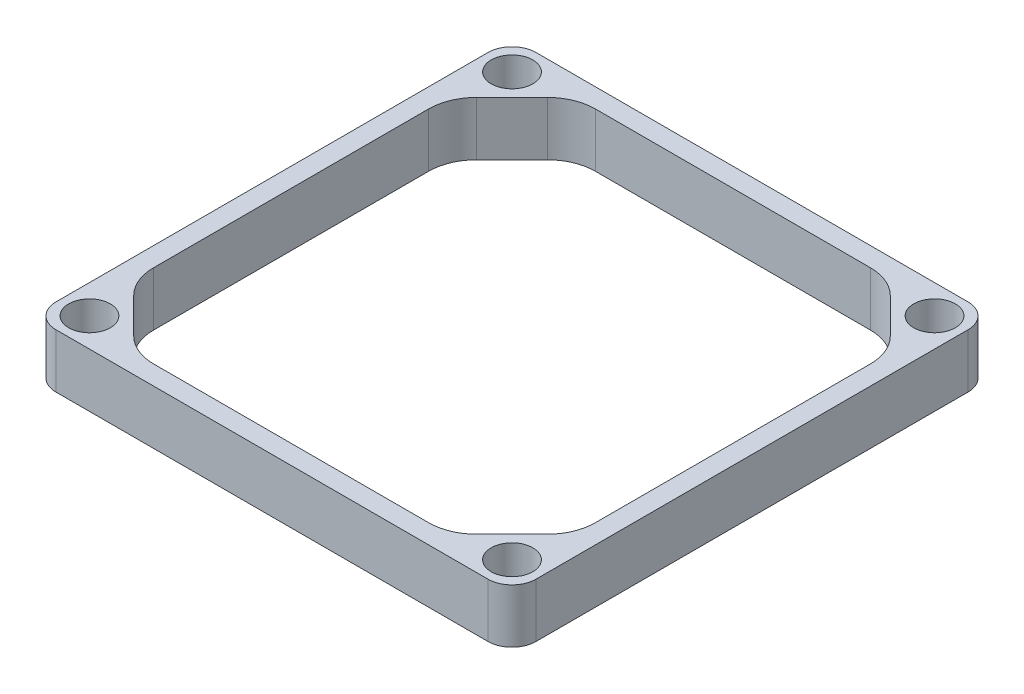
ISO-10303-21;
HEADER;
FILE_DESCRIPTION(('STEP AP214'),'2;1');
FILE_NAME('part.step','',(''),(''),'','','');
FILE_SCHEMA(('AUTOMOTIVE_DESIGN { 1 0 10303 214 1 1 1 1 }'));
ENDSEC;
DATA;
#1=APPLICATION_CONTEXT('core data for automotive mechanical design processes');
#2=APPLICATION_PROTOCOL_DEFINITION('international standard','automotive_design',2000,#1);
#3=PRODUCT_CONTEXT('',#1,'mechanical');
#4=PRODUCT('Part','Part','',(#3));
#5=PRODUCT_RELATED_PRODUCT_CATEGORY('part','',(#4));
#6=PRODUCT_DEFINITION_FORMATION('','',#4);
#7=PRODUCT_DEFINITION_CONTEXT('part definition',#1,'design');
#8=PRODUCT_DEFINITION('design','',#6,#7);
#9=PRODUCT_DEFINITION_SHAPE('','',#8);
#10=(LENGTH_UNIT() NAMED_UNIT(*) SI_UNIT(.MILLI.,.METRE.));
#11=(NAMED_UNIT(*) PLANE_ANGLE_UNIT() SI_UNIT($,.RADIAN.));
#12=(NAMED_UNIT(*) SI_UNIT($,.STERADIAN.) SOLID_ANGLE_UNIT());
#13=UNCERTAINTY_MEASURE_WITH_UNIT(LENGTH_MEASURE(1.E-05),#10,'distance_accuracy_value','');
#14=(GEOMETRIC_REPRESENTATION_CONTEXT(3) GLOBAL_UNCERTAINTY_ASSIGNED_CONTEXT((#13)) GLOBAL_UNIT_ASSIGNED_CONTEXT((#10,
#11,#12)) REPRESENTATION_CONTEXT('',''));
#15=CARTESIAN_POINT('',(0.,0.,0.));
#16=DIRECTION('',(0.,0.,1.));
#17=DIRECTION('',(1.,0.,0.));
#18=AXIS2_PLACEMENT_3D('',#15,#16,#17);
#19=CARTESIAN_POINT('',(-57.15,3.175,57.15));
#20=DIRECTION('',(0.,-1.,0.));
#21=DIRECTION('',(0.,0.,-1.));
#22=AXIS2_PLACEMENT_3D('',#19,#20,#21);
#23=CYLINDRICAL_SURFACE('',#22,6.35);
#24=CARTESIAN_POINT('',(-57.15,14.2875,57.15));
#25=DIRECTION('',(0.,-1.,0.));
#26=DIRECTION('',(0.,0.,-1.));
#27=AXIS2_PLACEMENT_3D('',#24,#25,#26);
#28=CIRCLE('',#27,6.35);
#29=CARTESIAN_POINT('',(-57.15,14.2875,63.5));
#30=VERTEX_POINT('',#29);
#31=CARTESIAN_POINT('',(-63.5,14.2875,57.15));
#32=VERTEX_POINT('',#31);
#33=EDGE_CURVE('E48',#30,#32,#28,.T.);
#34=ORIENTED_EDGE('',*,*,#33,.F.);
#35=DIRECTION('',(0.,-1.,0.));
#36=VECTOR('',#35,1.);
#37=CARTESIAN_POINT('',(-57.15,3.175,63.5));
#38=LINE('',#37,#36);
#39=CARTESIAN_POINT('',(-57.15,28.575,63.5));
#40=VERTEX_POINT('',#39);
#41=EDGE_CURVE('E11',#40,#30,#38,.T.);
#42=ORIENTED_EDGE('',*,*,#41,.F.);
#43=CARTESIAN_POINT('',(-57.15,28.575,57.15));
#44=DIRECTION('',(0.,1.,0.));
#45=DIRECTION('',(0.,0.,1.));
#46=AXIS2_PLACEMENT_3D('',#43,#44,#45);
#47=CIRCLE('',#46,6.35);
#48=CARTESIAN_POINT('',(-63.5,28.575,57.15));
#49=VERTEX_POINT('',#48);
#50=EDGE_CURVE('E262',#49,#40,#47,.T.);
#51=ORIENTED_EDGE('',*,*,#50,.F.);
#52=DIRECTION('',(0.,-1.,0.));
#53=VECTOR('',#52,1.);
#54=CARTESIAN_POINT('',(-63.5,3.175,57.15));
#55=LINE('',#54,#53);
#56=EDGE_CURVE('E286',#49,#32,#55,.T.);
#57=ORIENTED_EDGE('',*,*,#56,.T.);
#58=EDGE_LOOP('',(#34,#42,#51,#57));
#59=FACE_BOUND('',#58,.T.);
#60=ADVANCED_FACE('F33',(#59),#23,.T.);
#61=CARTESIAN_POINT('',(-57.15,3.175,63.5));
#62=DIRECTION('',(0.,0.,-1.));
#63=DIRECTION('',(-1.,0.,0.));
#64=AXIS2_PLACEMENT_3D('',#61,#62,#63);
#65=PLANE('',#64);
#66=DIRECTION('',(-1.,0.,0.));
#67=VECTOR('',#66,1.);
#68=CARTESIAN_POINT('',(-57.15,14.2875,63.5));
#69=LINE('',#68,#67);
#70=CARTESIAN_POINT('',(57.15,14.2875,63.5));
#71=VERTEX_POINT('',#70);
#72=EDGE_CURVE('E314',#71,#30,#69,.T.);
#73=ORIENTED_EDGE('',*,*,#72,.F.);
#74=DIRECTION('',(0.,-1.,0.));
#75=VECTOR('',#74,1.);
#76=CARTESIAN_POINT('',(57.15,3.175,63.5));
#77=LINE('',#76,#75);
#78=CARTESIAN_POINT('',(57.15,28.575,63.5));
#79=VERTEX_POINT('',#78);
#80=EDGE_CURVE('E41',#79,#71,#77,.T.);
#81=ORIENTED_EDGE('',*,*,#80,.F.);
#82=DIRECTION('',(1.,0.,0.));
#83=VECTOR('',#82,1.);
#84=CARTESIAN_POINT('',(-57.15,28.575,63.5));
#85=LINE('',#84,#83);
#86=EDGE_CURVE('E265',#40,#79,#85,.T.);
#87=ORIENTED_EDGE('',*,*,#86,.F.);
#88=ORIENTED_EDGE('',*,*,#41,.T.);
#89=EDGE_LOOP('',(#73,#81,#87,#88));
#90=FACE_BOUND('',#89,.T.);
#91=ADVANCED_FACE('F313',(#90),#65,.F.);
#92=CARTESIAN_POINT('',(57.15,3.175,57.15));
#93=DIRECTION('',(0.,-1.,0.));
#94=DIRECTION('',(0.,0.,-1.));
#95=AXIS2_PLACEMENT_3D('',#92,#93,#94);
#96=CYLINDRICAL_SURFACE('',#95,6.35);
#97=CARTESIAN_POINT('',(57.15,14.2875,57.15));
#98=DIRECTION('',(0.,-1.,0.));
#99=DIRECTION('',(0.,0.,-1.));
#100=AXIS2_PLACEMENT_3D('',#97,#98,#99);
#101=CIRCLE('',#100,6.35);
#102=CARTESIAN_POINT('',(63.5,14.2875,57.15));
#103=VERTEX_POINT('',#102);
#104=EDGE_CURVE('E309',#103,#71,#101,.T.);
#105=ORIENTED_EDGE('',*,*,#104,.F.);
#106=DIRECTION('',(0.,-1.,0.));
#107=VECTOR('',#106,1.);
#108=CARTESIAN_POINT('',(63.5,3.175,57.15));
#109=LINE('',#108,#107);
#110=CARTESIAN_POINT('',(63.5,28.575,57.15));
#111=VERTEX_POINT('',#110);
#112=EDGE_CURVE('E301',#111,#103,#109,.T.);
#113=ORIENTED_EDGE('',*,*,#112,.F.);
#114=CARTESIAN_POINT('',(57.15,28.575,57.15));
#115=DIRECTION('',(0.,1.,0.));
#116=DIRECTION('',(0.,0.,1.));
#117=AXIS2_PLACEMENT_3D('',#114,#115,#116);
#118=CIRCLE('',#117,6.35);
#119=EDGE_CURVE('E268',#79,#111,#118,.T.);
#120=ORIENTED_EDGE('',*,*,#119,.F.);
#121=ORIENTED_EDGE('',*,*,#80,.T.);
#122=EDGE_LOOP('',(#105,#113,#120,#121));
#123=FACE_BOUND('',#122,.T.);
#124=ADVANCED_FACE('F308',(#123),#96,.T.);
#125=CARTESIAN_POINT('',(63.5,3.175,-57.15));
#126=DIRECTION('',(-1.,0.,0.));
#127=DIRECTION('',(0.,0.,1.));
#128=AXIS2_PLACEMENT_3D('',#125,#126,#127);
#129=PLANE('',#128);
#130=DIRECTION('',(0.,0.,1.));
#131=VECTOR('',#130,1.);
#132=CARTESIAN_POINT('',(63.5,14.2875,-57.15));
#133=LINE('',#132,#131);
#134=CARTESIAN_POINT('',(63.5,14.2875,-57.15));
#135=VERTEX_POINT('',#134);
#136=EDGE_CURVE('E378',#135,#103,#133,.T.);
#137=ORIENTED_EDGE('',*,*,#136,.F.);
#138=DIRECTION('',(0.,-1.,0.));
#139=VECTOR('',#138,1.);
#140=CARTESIAN_POINT('',(63.5,3.175,-57.15));
#141=LINE('',#140,#139);
#142=CARTESIAN_POINT('',(63.5,28.575,-57.15));
#143=VERTEX_POINT('',#142);
#144=EDGE_CURVE('E298',#143,#135,#141,.T.);
#145=ORIENTED_EDGE('',*,*,#144,.F.);
#146=DIRECTION('',(0.,0.,-1.));
#147=VECTOR('',#146,1.);
#148=CARTESIAN_POINT('',(63.5,28.575,57.15));
#149=LINE('',#148,#147);
#150=EDGE_CURVE('E271',#111,#143,#149,.T.);
#151=ORIENTED_EDGE('',*,*,#150,.F.);
#152=ORIENTED_EDGE('',*,*,#112,.T.);
#153=EDGE_LOOP('',(#137,#145,#151,#152));
#154=FACE_BOUND('',#153,.T.);
#155=ADVANCED_FACE('F382',(#154),#129,.F.);
#156=CARTESIAN_POINT('',(57.15,3.175,-57.15));
#157=DIRECTION('',(0.,-1.,0.));
#158=DIRECTION('',(0.,0.,-1.));
#159=AXIS2_PLACEMENT_3D('',#156,#157,#158);
#160=CYLINDRICAL_SURFACE('',#159,6.35);
#161=CARTESIAN_POINT('',(57.15,14.2875,-57.15));
#162=DIRECTION('',(0.,-1.,0.));
#163=DIRECTION('',(0.,0.,-1.));
#164=AXIS2_PLACEMENT_3D('',#161,#162,#163);
#165=CIRCLE('',#164,6.35);
#166=CARTESIAN_POINT('',(57.15,14.2875,-63.5));
#167=VERTEX_POINT('',#166);
#168=EDGE_CURVE('E376',#167,#135,#165,.T.);
#169=ORIENTED_EDGE('',*,*,#168,.F.);
#170=DIRECTION('',(0.,-1.,0.));
#171=VECTOR('',#170,1.);
#172=CARTESIAN_POINT('',(57.15,3.175,-63.5));
#173=LINE('',#172,#171);
#174=CARTESIAN_POINT('',(57.15,28.575,-63.5));
#175=VERTEX_POINT('',#174);
#176=EDGE_CURVE('E295',#175,#167,#173,.T.);
#177=ORIENTED_EDGE('',*,*,#176,.F.);
#178=CARTESIAN_POINT('',(57.15,28.575,-57.15));
#179=DIRECTION('',(0.,1.,0.));
#180=DIRECTION('',(0.,0.,1.));
#181=AXIS2_PLACEMENT_3D('',#178,#179,#180);
#182=CIRCLE('',#181,6.35);
#183=EDGE_CURVE('E274',#143,#175,#182,.T.);
#184=ORIENTED_EDGE('',*,*,#183,.F.);
#185=ORIENTED_EDGE('',*,*,#144,.T.);
#186=EDGE_LOOP('',(#169,#177,#184,#185));
#187=FACE_BOUND('',#186,.T.);
#188=ADVANCED_FACE('F385',(#187),#160,.T.);
#189=CARTESIAN_POINT('',(-57.15,3.175,-63.5));
#190=DIRECTION('',(0.,0.,1.));
#191=DIRECTION('',(1.,0.,0.));
#192=AXIS2_PLACEMENT_3D('',#189,#190,#191);
#193=PLANE('',#192);
#194=DIRECTION('',(1.,0.,0.));
#195=VECTOR('',#194,1.);
#196=CARTESIAN_POINT('',(-57.15,14.2875,-63.5));
#197=LINE('',#196,#195);
#198=CARTESIAN_POINT('',(-57.15,14.2875,-63.5));
#199=VERTEX_POINT('',#198);
#200=EDGE_CURVE('E374',#199,#167,#197,.T.);
#201=ORIENTED_EDGE('',*,*,#200,.F.);
#202=DIRECTION('',(0.,-1.,0.));
#203=VECTOR('',#202,1.);
#204=CARTESIAN_POINT('',(-57.15,3.175,-63.5));
#205=LINE('',#204,#203);
#206=CARTESIAN_POINT('',(-57.15,28.575,-63.5));
#207=VERTEX_POINT('',#206);
#208=EDGE_CURVE('E292',#207,#199,#205,.T.);
#209=ORIENTED_EDGE('',*,*,#208,.F.);
#210=DIRECTION('',(-1.,0.,0.));
#211=VECTOR('',#210,1.);
#212=CARTESIAN_POINT('',(57.15,28.575,-63.5));
#213=LINE('',#212,#211);
#214=EDGE_CURVE('E277',#175,#207,#213,.T.);
#215=ORIENTED_EDGE('',*,*,#214,.F.);
#216=ORIENTED_EDGE('',*,*,#176,.T.);
#217=EDGE_LOOP('',(#201,#209,#215,#216));
#218=FACE_BOUND('',#217,.T.);
#219=ADVANCED_FACE('F390',(#218),#193,.F.);
#220=CARTESIAN_POINT('',(-57.15,3.175,-57.15));
#221=DIRECTION('',(0.,-1.,0.));
#222=DIRECTION('',(0.,0.,-1.));
#223=AXIS2_PLACEMENT_3D('',#220,#221,#222);
#224=CYLINDRICAL_SURFACE('',#223,6.35);
#225=CARTESIAN_POINT('',(-57.15,14.2875,-57.15));
#226=DIRECTION('',(0.,-1.,0.));
#227=DIRECTION('',(0.,0.,-1.));
#228=AXIS2_PLACEMENT_3D('',#225,#226,#227);
#229=CIRCLE('',#228,6.35);
#230=CARTESIAN_POINT('',(-63.5,14.2875,-57.15));
#231=VERTEX_POINT('',#230);
#232=EDGE_CURVE('E372',#231,#199,#229,.T.);
#233=ORIENTED_EDGE('',*,*,#232,.F.);
#234=DIRECTION('',(0.,-1.,0.));
#235=VECTOR('',#234,1.);
#236=CARTESIAN_POINT('',(-63.5,3.175,-57.15));
#237=LINE('',#236,#235);
#238=CARTESIAN_POINT('',(-63.5,28.575,-57.15));
#239=VERTEX_POINT('',#238);
#240=EDGE_CURVE('E289',#239,#231,#237,.T.);
#241=ORIENTED_EDGE('',*,*,#240,.F.);
#242=CARTESIAN_POINT('',(-57.15,28.575,-57.15));
#243=DIRECTION('',(0.,1.,0.));
#244=DIRECTION('',(0.,0.,1.));
#245=AXIS2_PLACEMENT_3D('',#242,#243,#244);
#246=CIRCLE('',#245,6.35);
#247=EDGE_CURVE('E280',#207,#239,#246,.T.);
#248=ORIENTED_EDGE('',*,*,#247,.F.);
#249=ORIENTED_EDGE('',*,*,#208,.T.);
#250=EDGE_LOOP('',(#233,#241,#248,#249));
#251=FACE_BOUND('',#250,.T.);
#252=ADVANCED_FACE('F393',(#251),#224,.T.);
#253=CARTESIAN_POINT('',(-63.5,3.175,-57.15));
#254=DIRECTION('',(1.,0.,0.));
#255=DIRECTION('',(0.,0.,-1.));
#256=AXIS2_PLACEMENT_3D('',#253,#254,#255);
#257=PLANE('',#256);
#258=DIRECTION('',(0.,0.,-1.));
#259=VECTOR('',#258,1.);
#260=CARTESIAN_POINT('',(-63.5,14.2875,-57.15));
#261=LINE('',#260,#259);
#262=EDGE_CURVE('E209',#32,#231,#261,.T.);
#263=ORIENTED_EDGE('',*,*,#262,.F.);
#264=ORIENTED_EDGE('',*,*,#56,.F.);
#265=DIRECTION('',(0.,0.,1.));
#266=VECTOR('',#265,1.);
#267=CARTESIAN_POINT('',(-63.5,28.575,-57.15));
#268=LINE('',#267,#266);
#269=EDGE_CURVE('E283',#239,#49,#268,.T.);
#270=ORIENTED_EDGE('',*,*,#269,.F.);
#271=ORIENTED_EDGE('',*,*,#240,.T.);
#272=EDGE_LOOP('',(#263,#264,#270,#271));
#273=FACE_BOUND('',#272,.T.);
#274=ADVANCED_FACE('F395',(#273),#257,.F.);
#275=CARTESIAN_POINT('',(36.3787193946549,28.575,-45.7200000000006));
#276=DIRECTION('',(0.,-1.,0.));
#277=DIRECTION('',(0.,0.,-1.));
#278=AXIS2_PLACEMENT_3D('',#275,#276,#277);
#279=CYLINDRICAL_SURFACE('',#278,12.7000000000067);
#280=DIRECTION('',(0.,-1.,0.));
#281=VECTOR('',#280,1.);
#282=CARTESIAN_POINT('',(36.3787193946544,28.575,-58.4200000000091));
#283=LINE('',#282,#281);
#284=CARTESIAN_POINT('',(36.3787193946544,28.575,-58.4200000000091));
#285=VERTEX_POINT('',#284);
#286=CARTESIAN_POINT('',(36.3787193946544,14.2875,-58.4200000000091));
#287=VERTEX_POINT('',#286);
#288=EDGE_CURVE('E208',#285,#287,#283,.T.);
#289=ORIENTED_EDGE('',*,*,#288,.T.);
#290=CARTESIAN_POINT('',(36.3787193946549,14.2875,-45.7200000000006));
#291=DIRECTION('',(0.,-1.,0.));
#292=DIRECTION('',(0.,0.,-1.));
#293=AXIS2_PLACEMENT_3D('',#290,#291,#292);
#294=CIRCLE('',#293,12.7000000000067);
#295=CARTESIAN_POINT('',(45.3589755157276,14.2875,-54.7002561210732));
#296=VERTEX_POINT('',#295);
#297=EDGE_CURVE('E194',#287,#296,#294,.T.);
#298=ORIENTED_EDGE('',*,*,#297,.T.);
#299=DIRECTION('',(0.,-1.,0.));
#300=VECTOR('',#299,1.);
#301=CARTESIAN_POINT('',(45.3589755157276,28.575,-54.7002561210732));
#302=LINE('',#301,#300);
#303=CARTESIAN_POINT('',(45.3589755157276,28.575,-54.7002561210732));
#304=VERTEX_POINT('',#303);
#305=EDGE_CURVE('E205',#304,#296,#302,.T.);
#306=ORIENTED_EDGE('',*,*,#305,.F.);
#307=CARTESIAN_POINT('',(36.3787193946549,28.575,-45.7200000000006));
#308=DIRECTION('',(0.,1.,0.));
#309=DIRECTION('',(0.,0.,-1.));
#310=AXIS2_PLACEMENT_3D('',#307,#308,#309);
#311=CIRCLE('',#310,12.7000000000067);
#312=EDGE_CURVE('E321',#304,#285,#311,.T.);
#313=ORIENTED_EDGE('',*,*,#312,.T.);
#314=EDGE_LOOP('',(#289,#298,#306,#313));
#315=FACE_BOUND('',#314,.T.);
#316=ADVANCED_FACE('F204',(#315),#279,.F.);
#317=CARTESIAN_POINT('',(-36.3787193946537,28.575,-58.420000000006));
#318=DIRECTION('',(0.,0.,1.));
#319=DIRECTION('',(1.,0.,0.));
#320=AXIS2_PLACEMENT_3D('',#317,#318,#319);
#321=PLANE('',#320);
#322=DIRECTION('',(0.,-1.,0.));
#323=VECTOR('',#322,1.);
#324=CARTESIAN_POINT('',(-36.3787193946537,28.575,-58.420000000006));
#325=LINE('',#324,#323);
#326=CARTESIAN_POINT('',(-36.3787193946537,28.575,-58.420000000006));
#327=VERTEX_POINT('',#326);
#328=CARTESIAN_POINT('',(-36.3787193946529,14.2875,-58.420000000006));
#329=VERTEX_POINT('',#328);
#330=EDGE_CURVE('E258',#327,#329,#325,.T.);
#331=ORIENTED_EDGE('',*,*,#330,.T.);
#332=DIRECTION('',(1.,0.,0.));
#333=VECTOR('',#332,1.);
#334=CARTESIAN_POINT('',(-36.3787193946537,14.2875,-58.420000000006));
#335=LINE('',#334,#333);
#336=EDGE_CURVE('E210',#329,#287,#335,.T.);
#337=ORIENTED_EDGE('',*,*,#336,.T.);
#338=ORIENTED_EDGE('',*,*,#288,.F.);
#339=DIRECTION('',(-1.,0.,0.));
#340=VECTOR('',#339,1.);
#341=CARTESIAN_POINT('',(-36.3787193946537,28.575,-58.420000000006));
#342=LINE('',#341,#340);
#343=EDGE_CURVE('E323',#285,#327,#342,.T.);
#344=ORIENTED_EDGE('',*,*,#343,.T.);
#345=EDGE_LOOP('',(#331,#337,#338,#344));
#346=FACE_BOUND('',#345,.T.);
#347=ADVANCED_FACE('F362',(#346),#321,.T.);
#348=CARTESIAN_POINT('',(-36.3787193946529,28.575,-45.7200000000003));
#349=DIRECTION('',(0.,-1.,0.));
#350=DIRECTION('',(0.,0.,-1.));
#351=AXIS2_PLACEMENT_3D('',#348,#349,#350);
#352=CYLINDRICAL_SURFACE('',#351,12.7000000000057);
#353=DIRECTION('',(0.,-1.,0.));
#354=VECTOR('',#353,1.);
#355=CARTESIAN_POINT('',(-45.3589755157258,28.575,-54.7002561210737));
#356=LINE('',#355,#354);
#357=CARTESIAN_POINT('',(-45.3589755157258,28.575,-54.7002561210737));
#358=VERTEX_POINT('',#357);
#359=CARTESIAN_POINT('',(-45.3589755157258,14.2875,-54.7002561210737));
#360=VERTEX_POINT('',#359);
#361=EDGE_CURVE('E255',#358,#360,#356,.T.);
#362=ORIENTED_EDGE('',*,*,#361,.T.);
#363=CARTESIAN_POINT('',(-36.3787193946529,14.2875,-45.7200000000003));
#364=DIRECTION('',(0.,-1.,0.));
#365=DIRECTION('',(0.,0.,-1.));
#366=AXIS2_PLACEMENT_3D('',#363,#364,#365);
#367=CIRCLE('',#366,12.7000000000057);
#368=EDGE_CURVE('E365',#360,#329,#367,.T.);
#369=ORIENTED_EDGE('',*,*,#368,.T.);
#370=ORIENTED_EDGE('',*,*,#330,.F.);
#371=CARTESIAN_POINT('',(-36.3787193946529,28.575,-45.7200000000003));
#372=DIRECTION('',(0.,1.,0.));
#373=DIRECTION('',(0.,0.,1.));
#374=AXIS2_PLACEMENT_3D('',#371,#372,#373);
#375=CIRCLE('',#374,12.7000000000057);
#376=EDGE_CURVE('E329',#327,#358,#375,.T.);
#377=ORIENTED_EDGE('',*,*,#376,.T.);
#378=EDGE_LOOP('',(#362,#369,#370,#377));
#379=FACE_BOUND('',#378,.T.);
#380=ADVANCED_FACE('F449',(#379),#352,.F.);
#381=CARTESIAN_POINT('',(-54.7002561210715,28.575,-45.358975515728));
#382=DIRECTION('',(0.707106781186547,0.,0.707106781186548));
#383=DIRECTION('',(0.707106781186548,0.,-0.707106781186547));
#384=AXIS2_PLACEMENT_3D('',#381,#382,#383);
#385=PLANE('',#384);
#386=DIRECTION('',(0.,-1.,0.));
#387=VECTOR('',#386,1.);
#388=CARTESIAN_POINT('',(-54.7002561210715,28.575,-45.358975515728));
#389=LINE('',#388,#387);
#390=CARTESIAN_POINT('',(-54.7002561210715,28.575,-45.358975515728));
#391=VERTEX_POINT('',#390);
#392=CARTESIAN_POINT('',(-54.7002561210731,14.2875,-45.3589755157296));
#393=VERTEX_POINT('',#392);
#394=EDGE_CURVE('E252',#391,#393,#389,.T.);
#395=ORIENTED_EDGE('',*,*,#394,.T.);
#396=DIRECTION('',(0.707106781186548,0.,-0.707106781186547));
#397=VECTOR('',#396,1.);
#398=CARTESIAN_POINT('',(-54.7002561210715,14.2875,-45.358975515728));
#399=LINE('',#398,#397);
#400=EDGE_CURVE('E367',#393,#360,#399,.T.);
#401=ORIENTED_EDGE('',*,*,#400,.T.);
#402=ORIENTED_EDGE('',*,*,#361,.F.);
#403=DIRECTION('',(-0.707106781186548,0.,0.707106781186547));
#404=VECTOR('',#403,1.);
#405=CARTESIAN_POINT('',(-54.7002561210715,28.575,-45.358975515728));
#406=LINE('',#405,#404);
#407=EDGE_CURVE('E331',#358,#391,#406,.T.);
#408=ORIENTED_EDGE('',*,*,#407,.T.);
#409=EDGE_LOOP('',(#395,#401,#402,#408));
#410=FACE_BOUND('',#409,.T.);
#411=ADVANCED_FACE('F458',(#410),#385,.T.);
#412=CARTESIAN_POINT('',(-45.7199999999987,28.575,-36.3787193946548));
#413=DIRECTION('',(0.,-1.,0.));
#414=DIRECTION('',(0.,0.,-1.));
#415=AXIS2_PLACEMENT_3D('',#412,#413,#414);
#416=CYLINDRICAL_SURFACE('',#415,12.7000000000076);
#417=DIRECTION('',(0.,-1.,0.));
#418=VECTOR('',#417,1.);
#419=CARTESIAN_POINT('',(-58.4200000000063,28.575,-36.3787193946547));
#420=LINE('',#419,#418);
#421=CARTESIAN_POINT('',(-58.4200000000063,28.575,-36.3787193946547));
#422=VERTEX_POINT('',#421);
#423=CARTESIAN_POINT('',(-58.4200000000085,14.2875,-36.3787193946547));
#424=VERTEX_POINT('',#423);
#425=EDGE_CURVE('E249',#422,#424,#420,.T.);
#426=ORIENTED_EDGE('',*,*,#425,.T.);
#427=CARTESIAN_POINT('',(-45.7199999999987,14.2875,-36.3787193946548));
#428=DIRECTION('',(0.,-1.,0.));
#429=DIRECTION('',(0.,0.,-1.));
#430=AXIS2_PLACEMENT_3D('',#427,#428,#429);
#431=CIRCLE('',#430,12.7000000000076);
#432=EDGE_CURVE('E802',#424,#393,#431,.T.);
#433=ORIENTED_EDGE('',*,*,#432,.T.);
#434=ORIENTED_EDGE('',*,*,#394,.F.);
#435=CARTESIAN_POINT('',(-45.7199999999987,28.575,-36.3787193946548));
#436=DIRECTION('',(0.,1.,0.));
#437=DIRECTION('',(0.,0.,-1.));
#438=AXIS2_PLACEMENT_3D('',#435,#436,#437);
#439=CIRCLE('',#438,12.7000000000076);
#440=EDGE_CURVE('E333',#391,#422,#439,.T.);
#441=ORIENTED_EDGE('',*,*,#440,.T.);
#442=EDGE_LOOP('',(#426,#433,#434,#441));
#443=FACE_BOUND('',#442,.T.);
#444=ADVANCED_FACE('F468',(#443),#416,.F.);
#445=CARTESIAN_POINT('',(-58.4200000000043,28.575,36.3787193946538));
#446=DIRECTION('',(1.,0.,0.));
#447=DIRECTION('',(0.,0.,-1.));
#448=AXIS2_PLACEMENT_3D('',#445,#446,#447);
#449=PLANE('',#448);
#450=DIRECTION('',(0.,-1.,0.));
#451=VECTOR('',#450,1.);
#452=CARTESIAN_POINT('',(-58.4200000000043,28.575,36.3787193946538));
#453=LINE('',#452,#451);
#454=CARTESIAN_POINT('',(-58.4200000000043,28.575,36.3787193946538));
#455=VERTEX_POINT('',#454);
#456=CARTESIAN_POINT('',(-58.4200000000049,14.2875,36.3787193946538));
#457=VERTEX_POINT('',#456);
#458=EDGE_CURVE('E246',#455,#457,#453,.T.);
#459=ORIENTED_EDGE('',*,*,#458,.T.);
#460=DIRECTION('',(0.,0.,-1.));
#461=VECTOR('',#460,1.);
#462=CARTESIAN_POINT('',(-58.4200000000043,14.2875,36.3787193946538));
#463=LINE('',#462,#461);
#464=EDGE_CURVE('E799',#457,#424,#463,.T.);
#465=ORIENTED_EDGE('',*,*,#464,.T.);
#466=ORIENTED_EDGE('',*,*,#425,.F.);
#467=DIRECTION('',(0.,0.,1.));
#468=VECTOR('',#467,1.);
#469=CARTESIAN_POINT('',(-58.4200000000043,28.575,36.3787193946538));
#470=LINE('',#469,#468);
#471=EDGE_CURVE('E335',#422,#455,#470,.T.);
#472=ORIENTED_EDGE('',*,*,#471,.T.);
#473=EDGE_LOOP('',(#459,#465,#466,#472));
#474=FACE_BOUND('',#473,.T.);
#475=ADVANCED_FACE('F478',(#474),#449,.T.);
#476=CARTESIAN_POINT('',(-45.7199999999994,28.575,36.378719394653));
#477=DIRECTION('',(0.,-1.,0.));
#478=DIRECTION('',(0.,0.,-1.));
#479=AXIS2_PLACEMENT_3D('',#476,#477,#478);
#480=CYLINDRICAL_SURFACE('',#479,12.7000000000055);
#481=DIRECTION('',(0.,-1.,0.));
#482=VECTOR('',#481,1.);
#483=CARTESIAN_POINT('',(-54.7002561210717,28.575,45.3589755157268));
#484=LINE('',#483,#482);
#485=CARTESIAN_POINT('',(-54.7002561210717,28.575,45.3589755157268));
#486=VERTEX_POINT('',#485);
#487=CARTESIAN_POINT('',(-54.7002561210717,14.2875,45.3589755157276));
#488=VERTEX_POINT('',#487);
#489=EDGE_CURVE('E243',#486,#488,#484,.T.);
#490=ORIENTED_EDGE('',*,*,#489,.T.);
#491=CARTESIAN_POINT('',(-45.7199999999994,14.2875,36.378719394653));
#492=DIRECTION('',(0.,-1.,0.));
#493=DIRECTION('',(0.,0.,-1.));
#494=AXIS2_PLACEMENT_3D('',#491,#492,#493);
#495=CIRCLE('',#494,12.7000000000055);
#496=EDGE_CURVE('E796',#488,#457,#495,.T.);
#497=ORIENTED_EDGE('',*,*,#496,.T.);
#498=ORIENTED_EDGE('',*,*,#458,.F.);
#499=CARTESIAN_POINT('',(-45.7199999999994,28.575,36.378719394653));
#500=DIRECTION('',(0.,1.,0.));
#501=DIRECTION('',(0.,0.,1.));
#502=AXIS2_PLACEMENT_3D('',#499,#500,#501);
#503=CIRCLE('',#502,12.7000000000055);
#504=EDGE_CURVE('E337',#455,#486,#503,.T.);
#505=ORIENTED_EDGE('',*,*,#504,.T.);
#506=EDGE_LOOP('',(#490,#497,#498,#505));
#507=FACE_BOUND('',#506,.T.);
#508=ADVANCED_FACE('F488',(#507),#480,.F.);
#509=CARTESIAN_POINT('',(-45.3589755157249,28.575,54.7002561210729));
#510=DIRECTION('',(0.707106781186492,0.,-0.707106781186603));
#511=DIRECTION('',(-0.707106781186603,0.,-0.707106781186492));
#512=AXIS2_PLACEMENT_3D('',#509,#510,#511);
#513=PLANE('',#512);
#514=DIRECTION('',(0.,-1.,0.));
#515=VECTOR('',#514,1.);
#516=CARTESIAN_POINT('',(-45.3589755157249,28.575,54.7002561210729));
#517=LINE('',#516,#515);
#518=CARTESIAN_POINT('',(-45.3589755157249,28.575,54.7002561210729));
#519=VERTEX_POINT('',#518);
#520=CARTESIAN_POINT('',(-45.3589755157251,14.2875,54.7002561210731));
#521=VERTEX_POINT('',#520);
#522=EDGE_CURVE('E240',#519,#521,#517,.T.);
#523=ORIENTED_EDGE('',*,*,#522,.T.);
#524=DIRECTION('',(-0.707106781186603,0.,-0.707106781186492));
#525=VECTOR('',#524,1.);
#526=CARTESIAN_POINT('',(-45.3589755157249,14.2875,54.7002561210729));
#527=LINE('',#526,#525);
#528=EDGE_CURVE('E793',#521,#488,#527,.T.);
#529=ORIENTED_EDGE('',*,*,#528,.T.);
#530=ORIENTED_EDGE('',*,*,#489,.F.);
#531=DIRECTION('',(0.707106781186603,0.,0.707106781186492));
#532=VECTOR('',#531,1.);
#533=CARTESIAN_POINT('',(-45.3589755157249,28.575,54.7002561210729));
#534=LINE('',#533,#532);
#535=EDGE_CURVE('E339',#486,#519,#534,.T.);
#536=ORIENTED_EDGE('',*,*,#535,.T.);
#537=EDGE_LOOP('',(#523,#529,#530,#536));
#538=FACE_BOUND('',#537,.T.);
#539=ADVANCED_FACE('F498',(#538),#513,.T.);
#540=CARTESIAN_POINT('',(-36.378719394653,28.575,45.7199999999995));
#541=DIRECTION('',(0.,-1.,0.));
#542=DIRECTION('',(0.,0.,-1.));
#543=AXIS2_PLACEMENT_3D('',#540,#541,#542);
#544=CYLINDRICAL_SURFACE('',#543,12.7000000000052);
#545=DIRECTION('',(0.,-1.,0.));
#546=VECTOR('',#545,1.);
#547=CARTESIAN_POINT('',(-36.378719394653,28.575,58.4200000000047));
#548=LINE('',#547,#546);
#549=CARTESIAN_POINT('',(-36.378719394653,28.575,58.4200000000047));
#550=VERTEX_POINT('',#549);
#551=CARTESIAN_POINT('',(-36.378719394653,14.2875,58.4200000000049));
#552=VERTEX_POINT('',#551);
#553=EDGE_CURVE('E237',#550,#552,#548,.T.);
#554=ORIENTED_EDGE('',*,*,#553,.T.);
#555=CARTESIAN_POINT('',(-36.378719394653,14.2875,45.7199999999995));
#556=DIRECTION('',(0.,-1.,0.));
#557=DIRECTION('',(0.,0.,-1.));
#558=AXIS2_PLACEMENT_3D('',#555,#556,#557);
#559=CIRCLE('',#558,12.7000000000052);
#560=EDGE_CURVE('E790',#552,#521,#559,.T.);
#561=ORIENTED_EDGE('',*,*,#560,.T.);
#562=ORIENTED_EDGE('',*,*,#522,.F.);
#563=CARTESIAN_POINT('',(-36.378719394653,28.575,45.7199999999995));
#564=DIRECTION('',(0.,1.,0.));
#565=DIRECTION('',(0.,0.,-1.));
#566=AXIS2_PLACEMENT_3D('',#563,#564,#565);
#567=CIRCLE('',#566,12.7000000000052);
#568=EDGE_CURVE('E341',#519,#550,#567,.T.);
#569=ORIENTED_EDGE('',*,*,#568,.T.);
#570=EDGE_LOOP('',(#554,#561,#562,#569));
#571=FACE_BOUND('',#570,.T.);
#572=ADVANCED_FACE('F508',(#571),#544,.F.);
#573=CARTESIAN_POINT('',(-36.378719394653,28.575,58.4200000000049));
#574=DIRECTION('',(0.,0.,-1.));
#575=DIRECTION('',(-1.,0.,0.));
#576=AXIS2_PLACEMENT_3D('',#573,#574,#575);
#577=PLANE('',#576);
#578=DIRECTION('',(0.,-1.,0.));
#579=VECTOR('',#578,1.);
#580=CARTESIAN_POINT('',(36.3787193946556,28.575,58.4200000000049));
#581=LINE('',#580,#579);
#582=CARTESIAN_POINT('',(36.3787193946556,28.575,58.4200000000049));
#583=VERTEX_POINT('',#582);
#584=CARTESIAN_POINT('',(36.3787193946556,14.2875,58.4200000000049));
#585=VERTEX_POINT('',#584);
#586=EDGE_CURVE('E234',#583,#585,#581,.T.);
#587=ORIENTED_EDGE('',*,*,#586,.T.);
#588=DIRECTION('',(-1.,0.,0.));
#589=VECTOR('',#588,1.);
#590=CARTESIAN_POINT('',(-36.378719394653,14.2875,58.4200000000049));
#591=LINE('',#590,#589);
#592=EDGE_CURVE('E787',#585,#552,#591,.T.);
#593=ORIENTED_EDGE('',*,*,#592,.T.);
#594=ORIENTED_EDGE('',*,*,#553,.F.);
#595=DIRECTION('',(1.,0.,0.));
#596=VECTOR('',#595,1.);
#597=CARTESIAN_POINT('',(-36.378719394653,28.575,58.4200000000049));
#598=LINE('',#597,#596);
#599=EDGE_CURVE('E343',#550,#583,#598,.T.);
#600=ORIENTED_EDGE('',*,*,#599,.T.);
#601=EDGE_LOOP('',(#587,#593,#594,#600));
#602=FACE_BOUND('',#601,.T.);
#603=ADVANCED_FACE('F518',(#602),#577,.T.);
#604=CARTESIAN_POINT('',(36.3787193946556,28.575,45.72));
#605=DIRECTION('',(0.,-1.,0.));
#606=DIRECTION('',(0.,0.,-1.));
#607=AXIS2_PLACEMENT_3D('',#604,#605,#606);
#608=CYLINDRICAL_SURFACE('',#607,12.7000000000049);
#609=DIRECTION('',(0.,-1.,0.));
#610=VECTOR('',#609,1.);
#611=CARTESIAN_POINT('',(45.3589755157282,28.575,54.7002561210727));
#612=LINE('',#611,#610);
#613=CARTESIAN_POINT('',(45.3589755157282,28.575,54.7002561210727));
#614=VERTEX_POINT('',#613);
#615=CARTESIAN_POINT('',(45.3589755157282,14.2875,54.7002561210727));
#616=VERTEX_POINT('',#615);
#617=EDGE_CURVE('E231',#614,#616,#612,.T.);
#618=ORIENTED_EDGE('',*,*,#617,.T.);
#619=CARTESIAN_POINT('',(36.3787193946556,14.2875,45.72));
#620=DIRECTION('',(0.,-1.,0.));
#621=DIRECTION('',(0.,0.,-1.));
#622=AXIS2_PLACEMENT_3D('',#619,#620,#621);
#623=CIRCLE('',#622,12.7000000000049);
#624=EDGE_CURVE('E784',#616,#585,#623,.T.);
#625=ORIENTED_EDGE('',*,*,#624,.T.);
#626=ORIENTED_EDGE('',*,*,#586,.F.);
#627=CARTESIAN_POINT('',(36.3787193946556,28.575,45.72));
#628=DIRECTION('',(0.,1.,0.));
#629=DIRECTION('',(0.,0.,1.));
#630=AXIS2_PLACEMENT_3D('',#627,#628,#629);
#631=CIRCLE('',#630,12.7000000000049);
#632=EDGE_CURVE('E345',#583,#614,#631,.T.);
#633=ORIENTED_EDGE('',*,*,#632,.T.);
#634=EDGE_LOOP('',(#618,#625,#626,#633));
#635=FACE_BOUND('',#634,.T.);
#636=ADVANCED_FACE('F528',(#635),#608,.F.);
#637=CARTESIAN_POINT('',(54.7002561210755,28.575,45.3589755157255));
#638=DIRECTION('',(-0.707106781186544,0.,-0.707106781186551));
#639=DIRECTION('',(-0.707106781186551,0.,0.707106781186544));
#640=AXIS2_PLACEMENT_3D('',#637,#638,#639);
#641=PLANE('',#640);
#642=DIRECTION('',(0.,-1.,0.));
#643=VECTOR('',#642,1.);
#644=CARTESIAN_POINT('',(54.7002561210755,28.575,45.3589755157255));
#645=LINE('',#644,#643);
#646=CARTESIAN_POINT('',(54.7002561210755,28.575,45.3589755157255));
#647=VERTEX_POINT('',#646);
#648=CARTESIAN_POINT('',(54.7002561210756,14.2875,45.3589755157256));
#649=VERTEX_POINT('',#648);
#650=EDGE_CURVE('E228',#647,#649,#645,.T.);
#651=ORIENTED_EDGE('',*,*,#650,.T.);
#652=DIRECTION('',(-0.707106781186551,0.,0.707106781186544));
#653=VECTOR('',#652,1.);
#654=CARTESIAN_POINT('',(54.7002561210755,14.2875,45.3589755157255));
#655=LINE('',#654,#653);
#656=EDGE_CURVE('E781',#649,#616,#655,.T.);
#657=ORIENTED_EDGE('',*,*,#656,.T.);
#658=ORIENTED_EDGE('',*,*,#617,.F.);
#659=DIRECTION('',(0.707106781186551,0.,-0.707106781186544));
#660=VECTOR('',#659,1.);
#661=CARTESIAN_POINT('',(54.7002561210755,28.575,45.3589755157255));
#662=LINE('',#661,#660);
#663=EDGE_CURVE('E347',#614,#647,#662,.T.);
#664=ORIENTED_EDGE('',*,*,#663,.T.);
#665=EDGE_LOOP('',(#651,#657,#658,#664));
#666=FACE_BOUND('',#665,.T.);
#667=ADVANCED_FACE('F538',(#666),#641,.T.);
#668=CARTESIAN_POINT('',(45.7200000000029,28.575,36.3787193946528));
#669=DIRECTION('',(0.,-1.,0.));
#670=DIRECTION('',(0.,0.,-1.));
#671=AXIS2_PLACEMENT_3D('',#668,#669,#670);
#672=CYLINDRICAL_SURFACE('',#671,12.7000000000051);
#673=DIRECTION('',(0.,-1.,0.));
#674=VECTOR('',#673,1.);
#675=CARTESIAN_POINT('',(58.420000000008,28.575,36.3787193946527));
#676=LINE('',#675,#674);
#677=CARTESIAN_POINT('',(58.420000000008,28.575,36.3787193946527));
#678=VERTEX_POINT('',#677);
#679=CARTESIAN_POINT('',(58.4200000000082,14.2875,36.3787193946527));
#680=VERTEX_POINT('',#679);
#681=EDGE_CURVE('E225',#678,#680,#676,.T.);
#682=ORIENTED_EDGE('',*,*,#681,.T.);
#683=CARTESIAN_POINT('',(45.7200000000029,14.2875,36.3787193946528));
#684=DIRECTION('',(0.,-1.,0.));
#685=DIRECTION('',(0.,0.,-1.));
#686=AXIS2_PLACEMENT_3D('',#683,#684,#685);
#687=CIRCLE('',#686,12.7000000000051);
#688=EDGE_CURVE('E778',#680,#649,#687,.T.);
#689=ORIENTED_EDGE('',*,*,#688,.T.);
#690=ORIENTED_EDGE('',*,*,#650,.F.);
#691=CARTESIAN_POINT('',(45.7200000000029,28.575,36.3787193946528));
#692=DIRECTION('',(0.,1.,0.));
#693=DIRECTION('',(0.,0.,-1.));
#694=AXIS2_PLACEMENT_3D('',#691,#692,#693);
#695=CIRCLE('',#694,12.7000000000051);
#696=EDGE_CURVE('E349',#647,#678,#695,.T.);
#697=ORIENTED_EDGE('',*,*,#696,.T.);
#698=EDGE_LOOP('',(#682,#689,#690,#697));
#699=FACE_BOUND('',#698,.T.);
#700=ADVANCED_FACE('F548',(#699),#672,.F.);
#701=CARTESIAN_POINT('',(58.4200000000082,28.575,36.3787193946527));
#702=DIRECTION('',(-1.,0.,0.));
#703=DIRECTION('',(0.,0.,1.));
#704=AXIS2_PLACEMENT_3D('',#701,#702,#703);
#705=PLANE('',#704);
#706=DIRECTION('',(0.,-1.,0.));
#707=VECTOR('',#706,1.);
#708=CARTESIAN_POINT('',(58.4200000000082,28.575,-36.3787193946521));
#709=LINE('',#708,#707);
#710=CARTESIAN_POINT('',(58.4200000000082,28.575,-36.3787193946521));
#711=VERTEX_POINT('',#710);
#712=CARTESIAN_POINT('',(58.4200000000082,14.2875,-36.3787193946521));
#713=VERTEX_POINT('',#712);
#714=EDGE_CURVE('E217',#711,#713,#709,.T.);
#715=ORIENTED_EDGE('',*,*,#714,.T.);
#716=DIRECTION('',(0.,0.,1.));
#717=VECTOR('',#716,1.);
#718=CARTESIAN_POINT('',(58.4200000000082,14.2875,36.3787193946527));
#719=LINE('',#718,#717);
#720=EDGE_CURVE('E775',#713,#680,#719,.T.);
#721=ORIENTED_EDGE('',*,*,#720,.T.);
#722=ORIENTED_EDGE('',*,*,#681,.F.);
#723=DIRECTION('',(0.,0.,-1.));
#724=VECTOR('',#723,1.);
#725=CARTESIAN_POINT('',(58.4200000000082,28.575,36.3787193946527));
#726=LINE('',#725,#724);
#727=EDGE_CURVE('E351',#678,#711,#726,.T.);
#728=ORIENTED_EDGE('',*,*,#727,.T.);
#729=EDGE_LOOP('',(#715,#721,#722,#728));
#730=FACE_BOUND('',#729,.T.);
#731=ADVANCED_FACE('F558',(#730),#705,.T.);
#732=CARTESIAN_POINT('',(45.7200000000033,28.575,-36.3787193946521));
#733=DIRECTION('',(0.,-1.,0.));
#734=DIRECTION('',(0.,0.,-1.));
#735=AXIS2_PLACEMENT_3D('',#732,#733,#734);
#736=CYLINDRICAL_SURFACE('',#735,12.7000000000049);
#737=DIRECTION('',(0.,-1.,0.));
#738=VECTOR('',#737,1.);
#739=CARTESIAN_POINT('',(54.700256121076,28.575,-45.3589755157247));
#740=LINE('',#739,#738);
#741=CARTESIAN_POINT('',(54.700256121076,28.575,-45.3589755157248));
#742=VERTEX_POINT('',#741);
#743=CARTESIAN_POINT('',(54.700256121076,14.2875,-45.3589755157247));
#744=VERTEX_POINT('',#743);
#745=EDGE_CURVE('E215',#742,#744,#740,.T.);
#746=ORIENTED_EDGE('',*,*,#745,.T.);
#747=CARTESIAN_POINT('',(45.7200000000033,14.2875,-36.3787193946521));
#748=DIRECTION('',(0.,-1.,0.));
#749=DIRECTION('',(0.,0.,-1.));
#750=AXIS2_PLACEMENT_3D('',#747,#748,#749);
#751=CIRCLE('',#750,12.7000000000049);
#752=EDGE_CURVE('E56',#744,#713,#751,.T.);
#753=ORIENTED_EDGE('',*,*,#752,.T.);
#754=ORIENTED_EDGE('',*,*,#714,.F.);
#755=CARTESIAN_POINT('',(45.7200000000033,28.575,-36.3787193946521));
#756=DIRECTION('',(0.,1.,0.));
#757=DIRECTION('',(0.,0.,1.));
#758=AXIS2_PLACEMENT_3D('',#755,#756,#757);
#759=CIRCLE('',#758,12.7000000000049);
#760=EDGE_CURVE('E219',#711,#742,#759,.T.);
#761=ORIENTED_EDGE('',*,*,#760,.T.);
#762=EDGE_LOOP('',(#746,#753,#754,#761));
#763=FACE_BOUND('',#762,.T.);
#764=ADVANCED_FACE('F356',(#763),#736,.F.);
#765=CARTESIAN_POINT('',(45.3589755157276,28.575,-54.7002561210732));
#766=DIRECTION('',(-0.707106781186552,0.,0.707106781186543));
#767=DIRECTION('',(0.707106781186543,0.,0.707106781186552));
#768=AXIS2_PLACEMENT_3D('',#765,#766,#767);
#769=PLANE('',#768);
#770=ORIENTED_EDGE('',*,*,#305,.T.);
#771=DIRECTION('',(0.707106781186543,0.,0.707106781186552));
#772=VECTOR('',#771,1.);
#773=CARTESIAN_POINT('',(45.3589755157276,14.2875,-54.7002561210732));
#774=LINE('',#773,#772);
#775=EDGE_CURVE('E191',#296,#744,#774,.T.);
#776=ORIENTED_EDGE('',*,*,#775,.T.);
#777=ORIENTED_EDGE('',*,*,#745,.F.);
#778=DIRECTION('',(-0.707106781186543,0.,-0.707106781186552));
#779=VECTOR('',#778,1.);
#780=CARTESIAN_POINT('',(45.3589755157276,28.575,-54.7002561210732));
#781=LINE('',#780,#779);
#782=EDGE_CURVE('E214',#742,#304,#781,.T.);
#783=ORIENTED_EDGE('',*,*,#782,.T.);
#784=EDGE_LOOP('',(#770,#776,#777,#783));
#785=FACE_BOUND('',#784,.T.);
#786=ADVANCED_FACE('F212',(#785),#769,.T.);
#787=CARTESIAN_POINT('',(55.88,0.,55.88));
#788=DIRECTION('',(0.,-1.,0.));
#789=DIRECTION('',(0.,0.,-1.));
#790=AXIS2_PLACEMENT_3D('',#787,#788,#789);
#791=CYLINDRICAL_SURFACE('',#790,3.50000000000001);
#792=CARTESIAN_POINT('',(55.88,20.035,55.88));
#793=DIRECTION('',(0.,1.,0.));
#794=DIRECTION('',(0.,0.,1.));
#795=AXIS2_PLACEMENT_3D('',#792,#793,#794);
#796=CIRCLE('',#795,3.5);
#797=CARTESIAN_POINT('',(55.88,20.035,59.38));
#798=VERTEX_POINT('',#797);
#799=EDGE_CURVE('E745',#798,#798,#796,.T.);
#800=ORIENTED_EDGE('',*,*,#799,.T.);
#801=EDGE_LOOP('',(#800));
#802=FACE_BOUND('',#801,.T.);
#803=CARTESIAN_POINT('',(55.88,14.2875,55.88));
#804=DIRECTION('',(0.,-1.,0.));
#805=DIRECTION('',(0.,0.,-1.));
#806=AXIS2_PLACEMENT_3D('',#803,#804,#805);
#807=CIRCLE('',#806,3.50000000000001);
#808=CARTESIAN_POINT('',(55.88,14.2875,52.38));
#809=VERTEX_POINT('',#808);
#810=EDGE_CURVE('E199',#809,#809,#807,.F.);
#811=ORIENTED_EDGE('',*,*,#810,.F.);
#812=EDGE_LOOP('',(#811));
#813=FACE_BOUND('',#812,.T.);
#814=ADVANCED_FACE('F585',(#802,#813),#791,.F.);
#815=CARTESIAN_POINT('',(-55.88,0.,55.88));
#816=DIRECTION('',(0.,-1.,0.));
#817=DIRECTION('',(0.,0.,-1.));
#818=AXIS2_PLACEMENT_3D('',#815,#816,#817);
#819=CYLINDRICAL_SURFACE('',#818,3.50000000000001);
#820=CARTESIAN_POINT('',(-55.88,20.035,55.88));
#821=DIRECTION('',(0.,1.,0.));
#822=DIRECTION('',(0.,0.,1.));
#823=AXIS2_PLACEMENT_3D('',#820,#821,#822);
#824=CIRCLE('',#823,3.5);
#825=CARTESIAN_POINT('',(-55.88,20.035,59.38));
#826=VERTEX_POINT('',#825);
#827=EDGE_CURVE('E754',#826,#826,#824,.T.);
#828=ORIENTED_EDGE('',*,*,#827,.T.);
#829=EDGE_LOOP('',(#828));
#830=FACE_BOUND('',#829,.T.);
#831=CARTESIAN_POINT('',(-55.88,14.2875,55.88));
#832=DIRECTION('',(0.,-1.,0.));
#833=DIRECTION('',(0.,0.,-1.));
#834=AXIS2_PLACEMENT_3D('',#831,#832,#833);
#835=CIRCLE('',#834,3.50000000000001);
#836=CARTESIAN_POINT('',(-55.88,14.2875,52.38));
#837=VERTEX_POINT('',#836);
#838=EDGE_CURVE('E769',#837,#837,#835,.F.);
#839=ORIENTED_EDGE('',*,*,#838,.F.);
#840=EDGE_LOOP('',(#839));
#841=FACE_BOUND('',#840,.T.);
#842=ADVANCED_FACE('F608',(#830,#841),#819,.F.);
#843=CARTESIAN_POINT('',(-55.88,0.,-55.88));
#844=DIRECTION('',(0.,-1.,0.));
#845=DIRECTION('',(0.,0.,-1.));
#846=AXIS2_PLACEMENT_3D('',#843,#844,#845);
#847=CYLINDRICAL_SURFACE('',#846,3.50000000000001);
#848=CARTESIAN_POINT('',(-55.88,20.035,-55.88));
#849=DIRECTION('',(0.,1.,0.));
#850=DIRECTION('',(0.,0.,1.));
#851=AXIS2_PLACEMENT_3D('',#848,#849,#850);
#852=CIRCLE('',#851,3.5);
#853=CARTESIAN_POINT('',(-55.88,20.035,-52.38));
#854=VERTEX_POINT('',#853);
#855=EDGE_CURVE('E763',#854,#854,#852,.T.);
#856=ORIENTED_EDGE('',*,*,#855,.T.);
#857=EDGE_LOOP('',(#856));
#858=FACE_BOUND('',#857,.T.);
#859=CARTESIAN_POINT('',(-55.88,14.2875,-55.88));
#860=DIRECTION('',(0.,-1.,0.));
#861=DIRECTION('',(0.,0.,-1.));
#862=AXIS2_PLACEMENT_3D('',#859,#860,#861);
#863=CIRCLE('',#862,3.50000000000001);
#864=CARTESIAN_POINT('',(-55.88,14.2875,-59.38));
#865=VERTEX_POINT('',#864);
#866=EDGE_CURVE('E766',#865,#865,#863,.F.);
#867=ORIENTED_EDGE('',*,*,#866,.F.);
#868=EDGE_LOOP('',(#867));
#869=FACE_BOUND('',#868,.T.);
#870=ADVANCED_FACE('F618',(#858,#869),#847,.F.);
#871=CARTESIAN_POINT('',(55.88,0.,-55.88));
#872=DIRECTION('',(0.,-1.,0.));
#873=DIRECTION('',(0.,0.,-1.));
#874=AXIS2_PLACEMENT_3D('',#871,#872,#873);
#875=CYLINDRICAL_SURFACE('',#874,3.50000000000001);
#876=CARTESIAN_POINT('',(55.88,20.035,-55.88));
#877=DIRECTION('',(0.,1.,0.));
#878=DIRECTION('',(0.,0.,1.));
#879=AXIS2_PLACEMENT_3D('',#876,#877,#878);
#880=CIRCLE('',#879,3.5);
#881=CARTESIAN_POINT('',(55.88,20.035,-52.38));
#882=VERTEX_POINT('',#881);
#883=EDGE_CURVE('E734',#882,#882,#880,.T.);
#884=ORIENTED_EDGE('',*,*,#883,.T.);
#885=EDGE_LOOP('',(#884));
#886=FACE_BOUND('',#885,.T.);
#887=CARTESIAN_POINT('',(55.88,14.2875,-55.88));
#888=DIRECTION('',(0.,-1.,0.));
#889=DIRECTION('',(0.,0.,-1.));
#890=AXIS2_PLACEMENT_3D('',#887,#888,#889);
#891=CIRCLE('',#890,3.50000000000001);
#892=CARTESIAN_POINT('',(55.88,14.2875,-59.38));
#893=VERTEX_POINT('',#892);
#894=EDGE_CURVE('E36',#893,#893,#891,.F.);
#895=ORIENTED_EDGE('',*,*,#894,.F.);
#896=EDGE_LOOP('',(#895));
#897=FACE_BOUND('',#896,.T.);
#898=ADVANCED_FACE('F628',(#886,#897),#875,.F.);
#899=CARTESIAN_POINT('',(-57.15,28.575,57.15));
#900=DIRECTION('',(0.,1.,0.));
#901=DIRECTION('',(0.,0.,1.));
#902=AXIS2_PLACEMENT_3D('',#899,#900,#901);
#903=PLANE('',#902);
#904=CARTESIAN_POINT('',(55.88,28.575,-55.88));
#905=DIRECTION('',(0.,1.,0.));
#906=DIRECTION('',(0.,0.,1.));
#907=AXIS2_PLACEMENT_3D('',#904,#905,#906);
#908=CIRCLE('',#907,5.49999999999999);
#909=CARTESIAN_POINT('',(55.88,28.575,-50.38));
#910=VERTEX_POINT('',#909);
#911=EDGE_CURVE('E732',#910,#910,#908,.T.);
#912=ORIENTED_EDGE('',*,*,#911,.F.);
#913=EDGE_LOOP('',(#912));
#914=FACE_BOUND('',#913,.T.);
#915=CARTESIAN_POINT('',(55.88,28.575,55.88));
#916=DIRECTION('',(0.,1.,0.));
#917=DIRECTION('',(0.,0.,1.));
#918=AXIS2_PLACEMENT_3D('',#915,#916,#917);
#919=CIRCLE('',#918,5.5);
#920=CARTESIAN_POINT('',(55.88,28.575,61.38));
#921=VERTEX_POINT('',#920);
#922=EDGE_CURVE('E739',#921,#921,#919,.T.);
#923=ORIENTED_EDGE('',*,*,#922,.F.);
#924=EDGE_LOOP('',(#923));
#925=FACE_BOUND('',#924,.T.);
#926=CARTESIAN_POINT('',(-55.88,28.575,55.88));
#927=DIRECTION('',(0.,1.,0.));
#928=DIRECTION('',(0.,0.,1.));
#929=AXIS2_PLACEMENT_3D('',#926,#927,#928);
#930=CIRCLE('',#929,5.49999999999999);
#931=CARTESIAN_POINT('',(-55.88,28.575,61.38));
#932=VERTEX_POINT('',#931);
#933=EDGE_CURVE('E748',#932,#932,#930,.T.);
#934=ORIENTED_EDGE('',*,*,#933,.F.);
#935=EDGE_LOOP('',(#934));
#936=FACE_BOUND('',#935,.T.);
#937=CARTESIAN_POINT('',(-55.88,28.575,-55.88));
#938=DIRECTION('',(0.,1.,0.));
#939=DIRECTION('',(0.,0.,1.));
#940=AXIS2_PLACEMENT_3D('',#937,#938,#939);
#941=CIRCLE('',#940,5.5);
#942=CARTESIAN_POINT('',(-55.88,28.575,-50.38));
#943=VERTEX_POINT('',#942);
#944=EDGE_CURVE('E757',#943,#943,#941,.T.);
#945=ORIENTED_EDGE('',*,*,#944,.F.);
#946=EDGE_LOOP('',(#945));
#947=FACE_BOUND('',#946,.T.);
#948=ORIENTED_EDGE('',*,*,#343,.F.);
#949=ORIENTED_EDGE('',*,*,#312,.F.);
#950=ORIENTED_EDGE('',*,*,#782,.F.);
#951=ORIENTED_EDGE('',*,*,#760,.F.);
#952=ORIENTED_EDGE('',*,*,#727,.F.);
#953=ORIENTED_EDGE('',*,*,#696,.F.);
#954=ORIENTED_EDGE('',*,*,#663,.F.);
#955=ORIENTED_EDGE('',*,*,#632,.F.);
#956=ORIENTED_EDGE('',*,*,#599,.F.);
#957=ORIENTED_EDGE('',*,*,#568,.F.);
#958=ORIENTED_EDGE('',*,*,#535,.F.);
#959=ORIENTED_EDGE('',*,*,#504,.F.);
#960=ORIENTED_EDGE('',*,*,#471,.F.);
#961=ORIENTED_EDGE('',*,*,#440,.F.);
#962=ORIENTED_EDGE('',*,*,#407,.F.);
#963=ORIENTED_EDGE('',*,*,#376,.F.);
#964=EDGE_LOOP('',(#948,#949,#950,#951,#952,#953,#954,#955,#956,#957,#958,#959,#960,#961,#962,#963));
#965=FACE_BOUND('',#964,.T.);
#966=ORIENTED_EDGE('',*,*,#50,.T.);
#967=ORIENTED_EDGE('',*,*,#86,.T.);
#968=ORIENTED_EDGE('',*,*,#119,.T.);
#969=ORIENTED_EDGE('',*,*,#150,.T.);
#970=ORIENTED_EDGE('',*,*,#183,.T.);
#971=ORIENTED_EDGE('',*,*,#214,.T.);
#972=ORIENTED_EDGE('',*,*,#247,.T.);
#973=ORIENTED_EDGE('',*,*,#269,.T.);
#974=EDGE_LOOP('',(#966,#967,#968,#969,#970,#971,#972,#973));
#975=FACE_BOUND('',#974,.T.);
#976=ADVANCED_FACE('F316',(#914,#925,#936,#947,#965,#975),#903,.T.);
#977=CARTESIAN_POINT('',(0.,14.2875,0.));
#978=DIRECTION('',(0.,-1.,0.));
#979=DIRECTION('',(0.,0.,-1.));
#980=AXIS2_PLACEMENT_3D('',#977,#978,#979);
#981=PLANE('',#980);
#982=ORIENTED_EDGE('',*,*,#810,.T.);
#983=EDGE_LOOP('',(#982));
#984=FACE_BOUND('',#983,.T.);
#985=ORIENTED_EDGE('',*,*,#838,.T.);
#986=EDGE_LOOP('',(#985));
#987=FACE_BOUND('',#986,.T.);
#988=ORIENTED_EDGE('',*,*,#866,.T.);
#989=EDGE_LOOP('',(#988));
#990=FACE_BOUND('',#989,.T.);
#991=ORIENTED_EDGE('',*,*,#894,.T.);
#992=EDGE_LOOP('',(#991));
#993=FACE_BOUND('',#992,.T.);
#994=ORIENTED_EDGE('',*,*,#336,.F.);
#995=ORIENTED_EDGE('',*,*,#368,.F.);
#996=ORIENTED_EDGE('',*,*,#400,.F.);
#997=ORIENTED_EDGE('',*,*,#432,.F.);
#998=ORIENTED_EDGE('',*,*,#464,.F.);
#999=ORIENTED_EDGE('',*,*,#496,.F.);
#1000=ORIENTED_EDGE('',*,*,#528,.F.);
#1001=ORIENTED_EDGE('',*,*,#560,.F.);
#1002=ORIENTED_EDGE('',*,*,#592,.F.);
#1003=ORIENTED_EDGE('',*,*,#624,.F.);
#1004=ORIENTED_EDGE('',*,*,#656,.F.);
#1005=ORIENTED_EDGE('',*,*,#688,.F.);
#1006=ORIENTED_EDGE('',*,*,#720,.F.);
#1007=ORIENTED_EDGE('',*,*,#752,.F.);
#1008=ORIENTED_EDGE('',*,*,#775,.F.);
#1009=ORIENTED_EDGE('',*,*,#297,.F.);
#1010=EDGE_LOOP('',(#994,#995,#996,#997,#998,#999,#1000,#1001,#1002,#1003,#1004,#1005,#1006,
#1007,#1008,#1009));
#1011=FACE_BOUND('',#1010,.T.);
#1012=ORIENTED_EDGE('',*,*,#33,.T.);
#1013=ORIENTED_EDGE('',*,*,#262,.T.);
#1014=ORIENTED_EDGE('',*,*,#232,.T.);
#1015=ORIENTED_EDGE('',*,*,#200,.T.);
#1016=ORIENTED_EDGE('',*,*,#168,.T.);
#1017=ORIENTED_EDGE('',*,*,#136,.T.);
#1018=ORIENTED_EDGE('',*,*,#104,.T.);
#1019=ORIENTED_EDGE('',*,*,#72,.T.);
#1020=EDGE_LOOP('',(#1012,#1013,#1014,#1015,#1016,#1017,#1018,#1019));
#1021=FACE_BOUND('',#1020,.T.);
#1022=ADVANCED_FACE('F193',(#984,#987,#990,#993,#1011,#1021),#981,.T.);
#1023=CARTESIAN_POINT('',(-52.38,20.035,-55.88));
#1024=DIRECTION('',(0.,-1.,0.));
#1025=DIRECTION('',(0.,0.,-1.));
#1026=AXIS2_PLACEMENT_3D('',#1023,#1024,#1025);
#1027=PLANE('',#1026);
#1028=ORIENTED_EDGE('',*,*,#855,.F.);
#1029=EDGE_LOOP('',(#1028));
#1030=FACE_BOUND('',#1029,.T.);
#1031=CARTESIAN_POINT('',(-55.88,20.035,-55.88));
#1032=DIRECTION('',(0.,1.,0.));
#1033=DIRECTION('',(0.,0.,1.));
#1034=AXIS2_PLACEMENT_3D('',#1031,#1032,#1033);
#1035=CIRCLE('',#1034,5.5);
#1036=CARTESIAN_POINT('',(-55.88,20.035,-50.38));
#1037=VERTEX_POINT('',#1036);
#1038=EDGE_CURVE('E760',#1037,#1037,#1035,.T.);
#1039=ORIENTED_EDGE('',*,*,#1038,.T.);
#1040=EDGE_LOOP('',(#1039));
#1041=FACE_BOUND('',#1040,.T.);
#1042=ADVANCED_FACE('F596',(#1030,#1041),#1027,.F.);
#1043=CARTESIAN_POINT('',(-55.88,28.575,-55.88));
#1044=DIRECTION('',(0.,1.,0.));
#1045=DIRECTION('',(0.,0.,1.));
#1046=AXIS2_PLACEMENT_3D('',#1043,#1044,#1045);
#1047=CYLINDRICAL_SURFACE('',#1046,5.5);
#1048=ORIENTED_EDGE('',*,*,#1038,.F.);
#1049=EDGE_LOOP('',(#1048));
#1050=FACE_BOUND('',#1049,.T.);
#1051=ORIENTED_EDGE('',*,*,#944,.T.);
#1052=EDGE_LOOP('',(#1051));
#1053=FACE_BOUND('',#1052,.T.);
#1054=ADVANCED_FACE('F652',(#1050,#1053),#1047,.F.);
#1055=CARTESIAN_POINT('',(-52.38,20.035,55.88));
#1056=DIRECTION('',(0.,-1.,0.));
#1057=DIRECTION('',(0.,0.,-1.));
#1058=AXIS2_PLACEMENT_3D('',#1055,#1056,#1057);
#1059=PLANE('',#1058);
#1060=ORIENTED_EDGE('',*,*,#827,.F.);
#1061=EDGE_LOOP('',(#1060));
#1062=FACE_BOUND('',#1061,.T.);
#1063=CARTESIAN_POINT('',(-55.88,20.035,55.88));
#1064=DIRECTION('',(0.,1.,0.));
#1065=DIRECTION('',(0.,0.,1.));
#1066=AXIS2_PLACEMENT_3D('',#1063,#1064,#1065);
#1067=CIRCLE('',#1066,5.5);
#1068=CARTESIAN_POINT('',(-55.88,20.035,61.38));
#1069=VERTEX_POINT('',#1068);
#1070=EDGE_CURVE('E751',#1069,#1069,#1067,.T.);
#1071=ORIENTED_EDGE('',*,*,#1070,.T.);
#1072=EDGE_LOOP('',(#1071));
#1073=FACE_BOUND('',#1072,.T.);
#1074=ADVANCED_FACE('F662',(#1062,#1073),#1059,.F.);
#1075=CARTESIAN_POINT('',(-55.88,28.575,55.88));
#1076=DIRECTION('',(0.,1.,0.));
#1077=DIRECTION('',(0.,0.,1.));
#1078=AXIS2_PLACEMENT_3D('',#1075,#1076,#1077);
#1079=CYLINDRICAL_SURFACE('',#1078,5.49999999999999);
#1080=ORIENTED_EDGE('',*,*,#1070,.F.);
#1081=EDGE_LOOP('',(#1080));
#1082=FACE_BOUND('',#1081,.T.);
#1083=ORIENTED_EDGE('',*,*,#933,.T.);
#1084=EDGE_LOOP('',(#1083));
#1085=FACE_BOUND('',#1084,.T.);
#1086=ADVANCED_FACE('F672',(#1082,#1085),#1079,.F.);
#1087=CARTESIAN_POINT('',(59.38,20.035,55.88));
#1088=DIRECTION('',(0.,-1.,0.));
#1089=DIRECTION('',(0.,0.,-1.));
#1090=AXIS2_PLACEMENT_3D('',#1087,#1088,#1089);
#1091=PLANE('',#1090);
#1092=ORIENTED_EDGE('',*,*,#799,.F.);
#1093=EDGE_LOOP('',(#1092));
#1094=FACE_BOUND('',#1093,.T.);
#1095=CARTESIAN_POINT('',(55.88,20.035,55.88));
#1096=DIRECTION('',(0.,1.,0.));
#1097=DIRECTION('',(0.,0.,1.));
#1098=AXIS2_PLACEMENT_3D('',#1095,#1096,#1097);
#1099=CIRCLE('',#1098,5.5);
#1100=CARTESIAN_POINT('',(55.88,20.035,61.38));
#1101=VERTEX_POINT('',#1100);
#1102=EDGE_CURVE('E742',#1101,#1101,#1099,.T.);
#1103=ORIENTED_EDGE('',*,*,#1102,.T.);
#1104=EDGE_LOOP('',(#1103));
#1105=FACE_BOUND('',#1104,.T.);
#1106=ADVANCED_FACE('F682',(#1094,#1105),#1091,.F.);
#1107=CARTESIAN_POINT('',(55.88,28.575,55.88));
#1108=DIRECTION('',(0.,1.,0.));
#1109=DIRECTION('',(0.,0.,1.));
#1110=AXIS2_PLACEMENT_3D('',#1107,#1108,#1109);
#1111=CYLINDRICAL_SURFACE('',#1110,5.5);
#1112=ORIENTED_EDGE('',*,*,#1102,.F.);
#1113=EDGE_LOOP('',(#1112));
#1114=FACE_BOUND('',#1113,.T.);
#1115=ORIENTED_EDGE('',*,*,#922,.T.);
#1116=EDGE_LOOP('',(#1115));
#1117=FACE_BOUND('',#1116,.T.);
#1118=ADVANCED_FACE('F692',(#1114,#1117),#1111,.F.);
#1119=CARTESIAN_POINT('',(59.38,20.035,-55.88));
#1120=DIRECTION('',(0.,-1.,0.));
#1121=DIRECTION('',(0.,0.,-1.));
#1122=AXIS2_PLACEMENT_3D('',#1119,#1120,#1121);
#1123=PLANE('',#1122);
#1124=ORIENTED_EDGE('',*,*,#883,.F.);
#1125=EDGE_LOOP('',(#1124));
#1126=FACE_BOUND('',#1125,.T.);
#1127=CARTESIAN_POINT('',(55.88,20.035,-55.88));
#1128=DIRECTION('',(0.,1.,0.));
#1129=DIRECTION('',(0.,0.,1.));
#1130=AXIS2_PLACEMENT_3D('',#1127,#1128,#1129);
#1131=CIRCLE('',#1130,5.5);
#1132=CARTESIAN_POINT('',(55.88,20.035,-50.38));
#1133=VERTEX_POINT('',#1132);
#1134=EDGE_CURVE('E729',#1133,#1133,#1131,.T.);
#1135=ORIENTED_EDGE('',*,*,#1134,.T.);
#1136=EDGE_LOOP('',(#1135));
#1137=FACE_BOUND('',#1136,.T.);
#1138=ADVANCED_FACE('F702',(#1126,#1137),#1123,.F.);
#1139=CARTESIAN_POINT('',(55.88,28.575,-55.88));
#1140=DIRECTION('',(0.,1.,0.));
#1141=DIRECTION('',(0.,0.,1.));
#1142=AXIS2_PLACEMENT_3D('',#1139,#1140,#1141);
#1143=CYLINDRICAL_SURFACE('',#1142,5.49999999999999);
#1144=ORIENTED_EDGE('',*,*,#1134,.F.);
#1145=EDGE_LOOP('',(#1144));
#1146=FACE_BOUND('',#1145,.T.);
#1147=ORIENTED_EDGE('',*,*,#911,.T.);
#1148=EDGE_LOOP('',(#1147));
#1149=FACE_BOUND('',#1148,.T.);
#1150=ADVANCED_FACE('F712',(#1146,#1149),#1143,.F.);
#1151=CLOSED_SHELL('',(#60,#91,#124,#155,#188,#219,#252,#274,#316,#347,#380,#411,#444,#475,#508,
#539,#572,#603,#636,#667,#700,#731,#764,#786,#814,#842,#870,#898,#976,#1022,#1042,#1054,#1074,
#1086,#1106,#1118,#1138,#1150));
#1152=MANIFOLD_SOLID_BREP('B2',#1151);
#1153=ADVANCED_BREP_SHAPE_REPRESENTATION('',(#18,#1152),#14);
#1154=SHAPE_DEFINITION_REPRESENTATION(#9,#1153);
ENDSEC;
END-ISO-10303-21;
